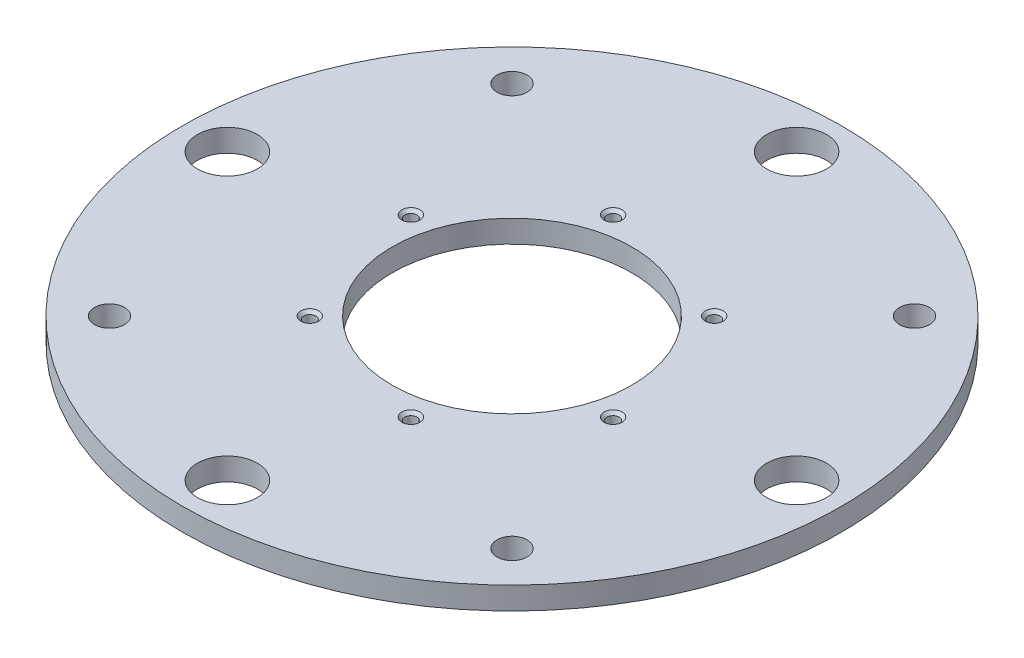
ISO-10303-21;
HEADER;
FILE_DESCRIPTION(('STEP AP214'),'2;1');
FILE_NAME('part.step','',(''),(''),'','','');
FILE_SCHEMA(('AUTOMOTIVE_DESIGN { 1 0 10303 214 1 1 1 1 }'));
ENDSEC;
DATA;
#1=APPLICATION_CONTEXT('core data for automotive mechanical design processes');
#2=APPLICATION_PROTOCOL_DEFINITION('international standard','automotive_design',2000,#1);
#3=PRODUCT_CONTEXT('',#1,'mechanical');
#4=PRODUCT('Part','Part','',(#3));
#5=PRODUCT_RELATED_PRODUCT_CATEGORY('part','',(#4));
#6=PRODUCT_DEFINITION_FORMATION('','',#4);
#7=PRODUCT_DEFINITION_CONTEXT('part definition',#1,'design');
#8=PRODUCT_DEFINITION('design','',#6,#7);
#9=PRODUCT_DEFINITION_SHAPE('','',#8);
#10=(LENGTH_UNIT() NAMED_UNIT(*) SI_UNIT(.MILLI.,.METRE.));
#11=(NAMED_UNIT(*) PLANE_ANGLE_UNIT() SI_UNIT($,.RADIAN.));
#12=(NAMED_UNIT(*) SI_UNIT($,.STERADIAN.) SOLID_ANGLE_UNIT());
#13=UNCERTAINTY_MEASURE_WITH_UNIT(LENGTH_MEASURE(1.E-05),#10,'distance_accuracy_value','');
#14=(GEOMETRIC_REPRESENTATION_CONTEXT(3) GLOBAL_UNCERTAINTY_ASSIGNED_CONTEXT((#13)) GLOBAL_UNIT_ASSIGNED_CONTEXT((#10,
#11,#12)) REPRESENTATION_CONTEXT('',''));
#15=CARTESIAN_POINT('',(0.,0.,0.));
#16=DIRECTION('',(0.,0.,1.));
#17=DIRECTION('',(1.,0.,0.));
#18=AXIS2_PLACEMENT_3D('',#15,#16,#17);
#19=CARTESIAN_POINT('',(0.,9.525,0.));
#20=DIRECTION('',(0.,1.,0.));
#21=DIRECTION('',(0.,0.,1.));
#22=AXIS2_PLACEMENT_3D('',#19,#20,#21);
#23=PLANE('',#22);
#24=CARTESIAN_POINT('',(-58.5454887757494,9.525,-15.6872164379448));
#25=DIRECTION('',(0.,1.,0.));
#26=DIRECTION('',(0.,0.,1.));
#27=AXIS2_PLACEMENT_3D('',#24,#25,#26);
#28=CIRCLE('',#27,3.81);
#29=CARTESIAN_POINT('',(-58.5454887757494,9.525,-11.8772164379448));
#30=VERTEX_POINT('',#29);
#31=EDGE_CURVE('E176',#30,#30,#28,.T.);
#32=ORIENTED_EDGE('',*,*,#31,.F.);
#33=EDGE_LOOP('',(#32));
#34=FACE_BOUND('',#33,.T.);
#35=CARTESIAN_POINT('',(-15.6872164379468,9.525,-58.5454887757503));
#36=DIRECTION('',(0.,1.,0.));
#37=DIRECTION('',(0.,0.,1.));
#38=AXIS2_PLACEMENT_3D('',#35,#36,#37);
#39=CIRCLE('',#38,3.81);
#40=CARTESIAN_POINT('',(-15.6872164379468,9.525,-54.7354887757503));
#41=VERTEX_POINT('',#40);
#42=EDGE_CURVE('E164',#41,#41,#39,.T.);
#43=ORIENTED_EDGE('',*,*,#42,.F.);
#44=EDGE_LOOP('',(#43));
#45=FACE_BOUND('',#44,.T.);
#46=CARTESIAN_POINT('',(42.8582723378026,9.525,-42.8582723378025));
#47=DIRECTION('',(0.,1.,0.));
#48=DIRECTION('',(0.,0.,1.));
#49=AXIS2_PLACEMENT_3D('',#46,#47,#48);
#50=CIRCLE('',#49,3.81);
#51=CARTESIAN_POINT('',(42.8582723378026,9.525,-39.0482723378025));
#52=VERTEX_POINT('',#51);
#53=EDGE_CURVE('E152',#52,#52,#50,.T.);
#54=ORIENTED_EDGE('',*,*,#53,.F.);
#55=EDGE_LOOP('',(#54));
#56=FACE_BOUND('',#55,.T.);
#57=CARTESIAN_POINT('',(58.5454887757501,9.525,15.6872164379478));
#58=DIRECTION('',(0.,1.,0.));
#59=DIRECTION('',(0.,0.,1.));
#60=AXIS2_PLACEMENT_3D('',#57,#58,#59);
#61=CIRCLE('',#60,3.81);
#62=CARTESIAN_POINT('',(58.5454887757501,9.525,19.4972164379478));
#63=VERTEX_POINT('',#62);
#64=EDGE_CURVE('E140',#63,#63,#61,.T.);
#65=ORIENTED_EDGE('',*,*,#64,.F.);
#66=EDGE_LOOP('',(#65));
#67=FACE_BOUND('',#66,.T.);
#68=CARTESIAN_POINT('',(15.6872164379472,9.525,58.5454887757502));
#69=DIRECTION('',(0.,1.,0.));
#70=DIRECTION('',(0.,0.,1.));
#71=AXIS2_PLACEMENT_3D('',#68,#69,#70);
#72=CIRCLE('',#71,3.81);
#73=CARTESIAN_POINT('',(15.6872164379472,9.525,62.3554887757502));
#74=VERTEX_POINT('',#73);
#75=EDGE_CURVE('E128',#74,#74,#72,.T.);
#76=ORIENTED_EDGE('',*,*,#75,.F.);
#77=EDGE_LOOP('',(#76));
#78=FACE_BOUND('',#77,.T.);
#79=CARTESIAN_POINT('',(-42.8582723378026,9.525,42.8582723378025));
#80=DIRECTION('',(0.,1.,0.));
#81=DIRECTION('',(0.,0.,1.));
#82=AXIS2_PLACEMENT_3D('',#79,#80,#81);
#83=CIRCLE('',#82,3.81);
#84=CARTESIAN_POINT('',(-42.8582723378026,9.525,46.6682723378025));
#85=VERTEX_POINT('',#84);
#86=EDGE_CURVE('E116',#85,#85,#83,.T.);
#87=ORIENTED_EDGE('',*,*,#86,.F.);
#88=EDGE_LOOP('',(#87));
#89=FACE_BOUND('',#88,.T.);
#90=CARTESIAN_POINT('',(-85.3124331501554,9.525,-85.3124331501519));
#91=DIRECTION('',(0.,1.,0.));
#92=DIRECTION('',(0.,0.,1.));
#93=AXIS2_PLACEMENT_3D('',#90,#91,#92);
#94=CIRCLE('',#93,6.34999999999999);
#95=CARTESIAN_POINT('',(-85.3124331501554,9.525,-78.962433150152));
#96=VERTEX_POINT('',#95);
#97=EDGE_CURVE('E66',#96,#96,#94,.T.);
#98=ORIENTED_EDGE('',*,*,#97,.F.);
#99=EDGE_LOOP('',(#98));
#100=FACE_BOUND('',#99,.T.);
#101=CARTESIAN_POINT('',(0.,9.525,-120.65));
#102=DIRECTION('',(0.,1.,0.));
#103=DIRECTION('',(0.,0.,1.));
#104=AXIS2_PLACEMENT_3D('',#101,#102,#103);
#105=CIRCLE('',#104,12.6746);
#106=CARTESIAN_POINT('',(0.,9.525,-107.9754));
#107=VERTEX_POINT('',#106);
#108=EDGE_CURVE('E103',#107,#107,#105,.T.);
#109=ORIENTED_EDGE('',*,*,#108,.F.);
#110=EDGE_LOOP('',(#109));
#111=FACE_BOUND('',#110,.T.);
#112=CARTESIAN_POINT('',(85.3124331501571,9.525,-85.3124331501568));
#113=DIRECTION('',(0.,1.,0.));
#114=DIRECTION('',(0.,0.,1.));
#115=AXIS2_PLACEMENT_3D('',#112,#113,#114);
#116=CIRCLE('',#115,6.34999999999999);
#117=CARTESIAN_POINT('',(85.3124331501571,9.525,-78.9624331501568));
#118=VERTEX_POINT('',#117);
#119=EDGE_CURVE('E97',#118,#118,#116,.T.);
#120=ORIENTED_EDGE('',*,*,#119,.F.);
#121=EDGE_LOOP('',(#120));
#122=FACE_BOUND('',#121,.T.);
#123=CARTESIAN_POINT('',(120.65,9.525,0.));
#124=DIRECTION('',(0.,1.,0.));
#125=DIRECTION('',(0.,0.,1.));
#126=AXIS2_PLACEMENT_3D('',#123,#124,#125);
#127=CIRCLE('',#126,12.6746);
#128=CARTESIAN_POINT('',(120.65,9.525,12.6746));
#129=VERTEX_POINT('',#128);
#130=EDGE_CURVE('E91',#129,#129,#127,.T.);
#131=ORIENTED_EDGE('',*,*,#130,.F.);
#132=EDGE_LOOP('',(#131));
#133=FACE_BOUND('',#132,.T.);
#134=CARTESIAN_POINT('',(85.312433150162,9.525,85.3124331501558));
#135=DIRECTION('',(0.,1.,0.));
#136=DIRECTION('',(0.,0.,1.));
#137=AXIS2_PLACEMENT_3D('',#134,#135,#136);
#138=CIRCLE('',#137,6.35000000000011);
#139=CARTESIAN_POINT('',(85.312433150162,9.525,91.6624331501559));
#140=VERTEX_POINT('',#139);
#141=EDGE_CURVE('E85',#140,#140,#138,.T.);
#142=ORIENTED_EDGE('',*,*,#141,.F.);
#143=EDGE_LOOP('',(#142));
#144=FACE_BOUND('',#143,.T.);
#145=CARTESIAN_POINT('',(0.,9.525,120.65));
#146=DIRECTION('',(0.,1.,0.));
#147=DIRECTION('',(0.,0.,1.));
#148=AXIS2_PLACEMENT_3D('',#145,#146,#147);
#149=CIRCLE('',#148,12.6746);
#150=CARTESIAN_POINT('',(0.,9.525,133.3246));
#151=VERTEX_POINT('',#150);
#152=EDGE_CURVE('E79',#151,#151,#149,.T.);
#153=ORIENTED_EDGE('',*,*,#152,.F.);
#154=EDGE_LOOP('',(#153));
#155=FACE_BOUND('',#154,.T.);
#156=CARTESIAN_POINT('',(-85.3124331501506,9.525,85.3124331501606));
#157=DIRECTION('',(0.,1.,0.));
#158=DIRECTION('',(0.,0.,1.));
#159=AXIS2_PLACEMENT_3D('',#156,#157,#158);
#160=CIRCLE('',#159,6.34999999999999);
#161=CARTESIAN_POINT('',(-85.3124331501506,9.525,91.6624331501606));
#162=VERTEX_POINT('',#161);
#163=EDGE_CURVE('E72',#162,#162,#160,.T.);
#164=ORIENTED_EDGE('',*,*,#163,.F.);
#165=EDGE_LOOP('',(#164));
#166=FACE_BOUND('',#165,.T.);
#167=CARTESIAN_POINT('',(-120.65,9.525,0.));
#168=DIRECTION('',(0.,1.,0.));
#169=DIRECTION('',(0.,0.,1.));
#170=AXIS2_PLACEMENT_3D('',#167,#168,#169);
#171=CIRCLE('',#170,12.6746);
#172=CARTESIAN_POINT('',(-120.65,9.525,12.6746));
#173=VERTEX_POINT('',#172);
#174=EDGE_CURVE('E63',#173,#173,#171,.T.);
#175=ORIENTED_EDGE('',*,*,#174,.F.);
#176=EDGE_LOOP('',(#175));
#177=FACE_BOUND('',#176,.T.);
#178=CARTESIAN_POINT('',(0.,9.525,0.));
#179=DIRECTION('',(0.,1.,0.));
#180=DIRECTION('',(0.,0.,1.));
#181=AXIS2_PLACEMENT_3D('',#178,#179,#180);
#182=CIRCLE('',#181,139.7);
#183=CARTESIAN_POINT('',(0.,9.525,139.7));
#184=VERTEX_POINT('',#183);
#185=EDGE_CURVE('E12',#184,#184,#182,.T.);
#186=ORIENTED_EDGE('',*,*,#185,.T.);
#187=EDGE_LOOP('',(#186));
#188=FACE_BOUND('',#187,.T.);
#189=CARTESIAN_POINT('',(0.,9.525,0.));
#190=DIRECTION('',(0.,1.,0.));
#191=DIRECTION('',(0.,0.,1.));
#192=AXIS2_PLACEMENT_3D('',#189,#190,#191);
#193=CIRCLE('',#192,50.8);
#194=CARTESIAN_POINT('',(0.,9.525,50.8));
#195=VERTEX_POINT('',#194);
#196=EDGE_CURVE('E55',#195,#195,#193,.T.);
#197=ORIENTED_EDGE('',*,*,#196,.F.);
#198=EDGE_LOOP('',(#197));
#199=FACE_BOUND('',#198,.T.);
#200=ADVANCED_FACE('F44',(#34,#45,#56,#67,#78,#89,#100,#111,#122,#133,#144,#155,#166,#177,#188,
#199),#23,.T.);
#201=CARTESIAN_POINT('',(0.,0.,0.));
#202=DIRECTION('',(0.,1.,0.));
#203=DIRECTION('',(0.,0.,1.));
#204=AXIS2_PLACEMENT_3D('',#201,#202,#203);
#205=PLANE('',#204);
#206=CARTESIAN_POINT('',(-58.5454887757494,0.,-15.6872164379448));
#207=DIRECTION('',(0.,1.,0.));
#208=DIRECTION('',(0.,0.,1.));
#209=AXIS2_PLACEMENT_3D('',#206,#207,#208);
#210=CIRCLE('',#209,3.80999999999999);
#211=CARTESIAN_POINT('',(-58.5454887757494,0.,-11.8772164379448));
#212=VERTEX_POINT('',#211);
#213=EDGE_CURVE('E179',#212,#212,#210,.T.);
#214=ORIENTED_EDGE('',*,*,#213,.T.);
#215=EDGE_LOOP('',(#214));
#216=FACE_BOUND('',#215,.T.);
#217=CARTESIAN_POINT('',(-15.6872164379468,0.,-58.5454887757503));
#218=DIRECTION('',(0.,1.,0.));
#219=DIRECTION('',(0.,0.,1.));
#220=AXIS2_PLACEMENT_3D('',#217,#218,#219);
#221=CIRCLE('',#220,3.81);
#222=CARTESIAN_POINT('',(-15.6872164379468,0.,-54.7354887757503));
#223=VERTEX_POINT('',#222);
#224=EDGE_CURVE('E167',#223,#223,#221,.T.);
#225=ORIENTED_EDGE('',*,*,#224,.T.);
#226=EDGE_LOOP('',(#225));
#227=FACE_BOUND('',#226,.T.);
#228=CARTESIAN_POINT('',(42.8582723378026,0.,-42.8582723378025));
#229=DIRECTION('',(0.,1.,0.));
#230=DIRECTION('',(0.,0.,1.));
#231=AXIS2_PLACEMENT_3D('',#228,#229,#230);
#232=CIRCLE('',#231,3.81);
#233=CARTESIAN_POINT('',(42.8582723378026,0.,-39.0482723378025));
#234=VERTEX_POINT('',#233);
#235=EDGE_CURVE('E155',#234,#234,#232,.T.);
#236=ORIENTED_EDGE('',*,*,#235,.T.);
#237=EDGE_LOOP('',(#236));
#238=FACE_BOUND('',#237,.T.);
#239=CARTESIAN_POINT('',(58.5454887757501,0.,15.6872164379478));
#240=DIRECTION('',(0.,1.,0.));
#241=DIRECTION('',(0.,0.,1.));
#242=AXIS2_PLACEMENT_3D('',#239,#240,#241);
#243=CIRCLE('',#242,3.80999999999999);
#244=CARTESIAN_POINT('',(58.5454887757501,0.,19.4972164379478));
#245=VERTEX_POINT('',#244);
#246=EDGE_CURVE('E143',#245,#245,#243,.T.);
#247=ORIENTED_EDGE('',*,*,#246,.T.);
#248=EDGE_LOOP('',(#247));
#249=FACE_BOUND('',#248,.T.);
#250=CARTESIAN_POINT('',(15.6872164379472,0.,58.5454887757502));
#251=DIRECTION('',(0.,1.,0.));
#252=DIRECTION('',(0.,0.,1.));
#253=AXIS2_PLACEMENT_3D('',#250,#251,#252);
#254=CIRCLE('',#253,3.81);
#255=CARTESIAN_POINT('',(15.6872164379472,0.,62.3554887757502));
#256=VERTEX_POINT('',#255);
#257=EDGE_CURVE('E131',#256,#256,#254,.T.);
#258=ORIENTED_EDGE('',*,*,#257,.T.);
#259=EDGE_LOOP('',(#258));
#260=FACE_BOUND('',#259,.T.);
#261=CARTESIAN_POINT('',(-42.8582723378026,0.,42.8582723378025));
#262=DIRECTION('',(0.,1.,0.));
#263=DIRECTION('',(0.,0.,1.));
#264=AXIS2_PLACEMENT_3D('',#261,#262,#263);
#265=CIRCLE('',#264,3.81);
#266=CARTESIAN_POINT('',(-42.8582723378026,0.,46.6682723378025));
#267=VERTEX_POINT('',#266);
#268=EDGE_CURVE('E119',#267,#267,#265,.T.);
#269=ORIENTED_EDGE('',*,*,#268,.T.);
#270=EDGE_LOOP('',(#269));
#271=FACE_BOUND('',#270,.T.);
#272=CARTESIAN_POINT('',(-85.3124331501554,0.,-85.3124331501519));
#273=DIRECTION('',(0.,1.,0.));
#274=DIRECTION('',(0.,0.,1.));
#275=AXIS2_PLACEMENT_3D('',#272,#273,#274);
#276=CIRCLE('',#275,6.34999999999999);
#277=CARTESIAN_POINT('',(-85.3124331501554,0.,-78.962433150152));
#278=VERTEX_POINT('',#277);
#279=EDGE_CURVE('E106',#278,#278,#276,.T.);
#280=ORIENTED_EDGE('',*,*,#279,.T.);
#281=EDGE_LOOP('',(#280));
#282=FACE_BOUND('',#281,.T.);
#283=CARTESIAN_POINT('',(0.,0.,-120.65));
#284=DIRECTION('',(0.,1.,0.));
#285=DIRECTION('',(0.,0.,1.));
#286=AXIS2_PLACEMENT_3D('',#283,#284,#285);
#287=CIRCLE('',#286,12.6746);
#288=CARTESIAN_POINT('',(0.,0.,-107.9754));
#289=VERTEX_POINT('',#288);
#290=EDGE_CURVE('E100',#289,#289,#287,.T.);
#291=ORIENTED_EDGE('',*,*,#290,.T.);
#292=EDGE_LOOP('',(#291));
#293=FACE_BOUND('',#292,.T.);
#294=CARTESIAN_POINT('',(85.3124331501571,0.,-85.3124331501568));
#295=DIRECTION('',(0.,1.,0.));
#296=DIRECTION('',(0.,0.,1.));
#297=AXIS2_PLACEMENT_3D('',#294,#295,#296);
#298=CIRCLE('',#297,6.34999999999999);
#299=CARTESIAN_POINT('',(85.3124331501571,0.,-78.9624331501568));
#300=VERTEX_POINT('',#299);
#301=EDGE_CURVE('E94',#300,#300,#298,.T.);
#302=ORIENTED_EDGE('',*,*,#301,.T.);
#303=EDGE_LOOP('',(#302));
#304=FACE_BOUND('',#303,.T.);
#305=CARTESIAN_POINT('',(120.65,0.,0.));
#306=DIRECTION('',(0.,1.,0.));
#307=DIRECTION('',(0.,0.,1.));
#308=AXIS2_PLACEMENT_3D('',#305,#306,#307);
#309=CIRCLE('',#308,12.6746);
#310=CARTESIAN_POINT('',(120.65,0.,12.6746));
#311=VERTEX_POINT('',#310);
#312=EDGE_CURVE('E88',#311,#311,#309,.T.);
#313=ORIENTED_EDGE('',*,*,#312,.T.);
#314=EDGE_LOOP('',(#313));
#315=FACE_BOUND('',#314,.T.);
#316=CARTESIAN_POINT('',(85.312433150162,0.,85.3124331501558));
#317=DIRECTION('',(0.,1.,0.));
#318=DIRECTION('',(0.,0.,1.));
#319=AXIS2_PLACEMENT_3D('',#316,#317,#318);
#320=CIRCLE('',#319,6.35000000000011);
#321=CARTESIAN_POINT('',(85.312433150162,0.,91.6624331501559));
#322=VERTEX_POINT('',#321);
#323=EDGE_CURVE('E82',#322,#322,#320,.T.);
#324=ORIENTED_EDGE('',*,*,#323,.T.);
#325=EDGE_LOOP('',(#324));
#326=FACE_BOUND('',#325,.T.);
#327=CARTESIAN_POINT('',(0.,0.,120.65));
#328=DIRECTION('',(0.,1.,0.));
#329=DIRECTION('',(0.,0.,1.));
#330=AXIS2_PLACEMENT_3D('',#327,#328,#329);
#331=CIRCLE('',#330,12.6746);
#332=CARTESIAN_POINT('',(0.,0.,133.3246));
#333=VERTEX_POINT('',#332);
#334=EDGE_CURVE('E76',#333,#333,#331,.T.);
#335=ORIENTED_EDGE('',*,*,#334,.T.);
#336=EDGE_LOOP('',(#335));
#337=FACE_BOUND('',#336,.T.);
#338=CARTESIAN_POINT('',(-85.3124331501506,0.,85.3124331501606));
#339=DIRECTION('',(0.,1.,0.));
#340=DIRECTION('',(0.,0.,1.));
#341=AXIS2_PLACEMENT_3D('',#338,#339,#340);
#342=CIRCLE('',#341,6.34999999999999);
#343=CARTESIAN_POINT('',(-85.3124331501506,0.,91.6624331501606));
#344=VERTEX_POINT('',#343);
#345=EDGE_CURVE('E69',#344,#344,#342,.T.);
#346=ORIENTED_EDGE('',*,*,#345,.T.);
#347=EDGE_LOOP('',(#346));
#348=FACE_BOUND('',#347,.T.);
#349=CARTESIAN_POINT('',(-120.65,0.,0.));
#350=DIRECTION('',(0.,1.,0.));
#351=DIRECTION('',(0.,0.,1.));
#352=AXIS2_PLACEMENT_3D('',#349,#350,#351);
#353=CIRCLE('',#352,12.6746);
#354=CARTESIAN_POINT('',(-120.65,0.,12.6746));
#355=VERTEX_POINT('',#354);
#356=EDGE_CURVE('E60',#355,#355,#353,.T.);
#357=ORIENTED_EDGE('',*,*,#356,.T.);
#358=EDGE_LOOP('',(#357));
#359=FACE_BOUND('',#358,.T.);
#360=CARTESIAN_POINT('',(0.,0.,0.));
#361=DIRECTION('',(0.,1.,0.));
#362=DIRECTION('',(0.,0.,1.));
#363=AXIS2_PLACEMENT_3D('',#360,#361,#362);
#364=CIRCLE('',#363,139.7);
#365=CARTESIAN_POINT('',(0.,0.,139.7));
#366=VERTEX_POINT('',#365);
#367=EDGE_CURVE('E48',#366,#366,#364,.T.);
#368=ORIENTED_EDGE('',*,*,#367,.F.);
#369=EDGE_LOOP('',(#368));
#370=FACE_BOUND('',#369,.T.);
#371=CARTESIAN_POINT('',(0.,0.,0.));
#372=DIRECTION('',(0.,1.,0.));
#373=DIRECTION('',(0.,0.,1.));
#374=AXIS2_PLACEMENT_3D('',#371,#372,#373);
#375=CIRCLE('',#374,50.8);
#376=CARTESIAN_POINT('',(0.,0.,50.8));
#377=VERTEX_POINT('',#376);
#378=EDGE_CURVE('E57',#377,#377,#375,.T.);
#379=ORIENTED_EDGE('',*,*,#378,.T.);
#380=EDGE_LOOP('',(#379));
#381=FACE_BOUND('',#380,.T.);
#382=ADVANCED_FACE('F183',(#216,#227,#238,#249,#260,#271,#282,#293,#304,#315,#326,#337,#348,
#359,#370,#381),#205,.F.);
#383=CARTESIAN_POINT('',(0.,9.525,0.));
#384=DIRECTION('',(0.,-1.,0.));
#385=DIRECTION('',(0.,0.,-1.));
#386=AXIS2_PLACEMENT_3D('',#383,#384,#385);
#387=CYLINDRICAL_SURFACE('',#386,139.7);
#388=ORIENTED_EDGE('',*,*,#185,.F.);
#389=EDGE_LOOP('',(#388));
#390=FACE_BOUND('',#389,.T.);
#391=ORIENTED_EDGE('',*,*,#367,.T.);
#392=EDGE_LOOP('',(#391));
#393=FACE_BOUND('',#392,.T.);
#394=ADVANCED_FACE('F46',(#390,#393),#387,.T.);
#395=CARTESIAN_POINT('',(0.,9.525,0.));
#396=DIRECTION('',(0.,-1.,0.));
#397=DIRECTION('',(0.,0.,-1.));
#398=AXIS2_PLACEMENT_3D('',#395,#396,#397);
#399=CYLINDRICAL_SURFACE('',#398,50.8);
#400=ORIENTED_EDGE('',*,*,#196,.T.);
#401=EDGE_LOOP('',(#400));
#402=FACE_BOUND('',#401,.T.);
#403=ORIENTED_EDGE('',*,*,#378,.F.);
#404=EDGE_LOOP('',(#403));
#405=FACE_BOUND('',#404,.T.);
#406=ADVANCED_FACE('F236',(#402,#405),#399,.F.);
#407=CARTESIAN_POINT('',(-120.65,0.,0.));
#408=DIRECTION('',(0.,1.,0.));
#409=DIRECTION('',(0.,0.,1.));
#410=AXIS2_PLACEMENT_3D('',#407,#408,#409);
#411=CYLINDRICAL_SURFACE('',#410,12.6746);
#412=ORIENTED_EDGE('',*,*,#356,.F.);
#413=EDGE_LOOP('',(#412));
#414=FACE_BOUND('',#413,.T.);
#415=ORIENTED_EDGE('',*,*,#174,.T.);
#416=EDGE_LOOP('',(#415));
#417=FACE_BOUND('',#416,.T.);
#418=ADVANCED_FACE('F239',(#414,#417),#411,.F.);
#419=CARTESIAN_POINT('',(-85.3124331501506,0.,85.3124331501606));
#420=DIRECTION('',(0.,1.,0.));
#421=DIRECTION('',(0.,0.,1.));
#422=AXIS2_PLACEMENT_3D('',#419,#420,#421);
#423=CYLINDRICAL_SURFACE('',#422,6.34999999999999);
#424=ORIENTED_EDGE('',*,*,#345,.F.);
#425=EDGE_LOOP('',(#424));
#426=FACE_BOUND('',#425,.T.);
#427=ORIENTED_EDGE('',*,*,#163,.T.);
#428=EDGE_LOOP('',(#427));
#429=FACE_BOUND('',#428,.T.);
#430=ADVANCED_FACE('F251',(#426,#429),#423,.F.);
#431=CARTESIAN_POINT('',(0.,0.,120.65));
#432=DIRECTION('',(0.,1.,0.));
#433=DIRECTION('',(0.,0.,1.));
#434=AXIS2_PLACEMENT_3D('',#431,#432,#433);
#435=CYLINDRICAL_SURFACE('',#434,12.6746);
#436=ORIENTED_EDGE('',*,*,#334,.F.);
#437=EDGE_LOOP('',(#436));
#438=FACE_BOUND('',#437,.T.);
#439=ORIENTED_EDGE('',*,*,#152,.T.);
#440=EDGE_LOOP('',(#439));
#441=FACE_BOUND('',#440,.T.);
#442=ADVANCED_FACE('F255',(#438,#441),#435,.F.);
#443=CARTESIAN_POINT('',(85.312433150162,0.,85.3124331501558));
#444=DIRECTION('',(0.,1.,0.));
#445=DIRECTION('',(0.,0.,1.));
#446=AXIS2_PLACEMENT_3D('',#443,#444,#445);
#447=CYLINDRICAL_SURFACE('',#446,6.35000000000011);
#448=ORIENTED_EDGE('',*,*,#323,.F.);
#449=EDGE_LOOP('',(#448));
#450=FACE_BOUND('',#449,.T.);
#451=ORIENTED_EDGE('',*,*,#141,.T.);
#452=EDGE_LOOP('',(#451));
#453=FACE_BOUND('',#452,.T.);
#454=ADVANCED_FACE('F259',(#450,#453),#447,.F.);
#455=CARTESIAN_POINT('',(120.65,0.,0.));
#456=DIRECTION('',(0.,1.,0.));
#457=DIRECTION('',(0.,0.,1.));
#458=AXIS2_PLACEMENT_3D('',#455,#456,#457);
#459=CYLINDRICAL_SURFACE('',#458,12.6746);
#460=ORIENTED_EDGE('',*,*,#312,.F.);
#461=EDGE_LOOP('',(#460));
#462=FACE_BOUND('',#461,.T.);
#463=ORIENTED_EDGE('',*,*,#130,.T.);
#464=EDGE_LOOP('',(#463));
#465=FACE_BOUND('',#464,.T.);
#466=ADVANCED_FACE('F263',(#462,#465),#459,.F.);
#467=CARTESIAN_POINT('',(85.3124331501571,0.,-85.3124331501568));
#468=DIRECTION('',(0.,1.,0.));
#469=DIRECTION('',(0.,0.,1.));
#470=AXIS2_PLACEMENT_3D('',#467,#468,#469);
#471=CYLINDRICAL_SURFACE('',#470,6.34999999999999);
#472=ORIENTED_EDGE('',*,*,#301,.F.);
#473=EDGE_LOOP('',(#472));
#474=FACE_BOUND('',#473,.T.);
#475=ORIENTED_EDGE('',*,*,#119,.T.);
#476=EDGE_LOOP('',(#475));
#477=FACE_BOUND('',#476,.T.);
#478=ADVANCED_FACE('F267',(#474,#477),#471,.F.);
#479=CARTESIAN_POINT('',(0.,0.,-120.65));
#480=DIRECTION('',(0.,1.,0.));
#481=DIRECTION('',(0.,0.,1.));
#482=AXIS2_PLACEMENT_3D('',#479,#480,#481);
#483=CYLINDRICAL_SURFACE('',#482,12.6746);
#484=ORIENTED_EDGE('',*,*,#290,.F.);
#485=EDGE_LOOP('',(#484));
#486=FACE_BOUND('',#485,.T.);
#487=ORIENTED_EDGE('',*,*,#108,.T.);
#488=EDGE_LOOP('',(#487));
#489=FACE_BOUND('',#488,.T.);
#490=ADVANCED_FACE('F271',(#486,#489),#483,.F.);
#491=CARTESIAN_POINT('',(-85.3124331501554,0.,-85.3124331501519));
#492=DIRECTION('',(0.,1.,0.));
#493=DIRECTION('',(0.,0.,1.));
#494=AXIS2_PLACEMENT_3D('',#491,#492,#493);
#495=CYLINDRICAL_SURFACE('',#494,6.34999999999999);
#496=ORIENTED_EDGE('',*,*,#279,.F.);
#497=EDGE_LOOP('',(#496));
#498=FACE_BOUND('',#497,.T.);
#499=ORIENTED_EDGE('',*,*,#97,.T.);
#500=EDGE_LOOP('',(#499));
#501=FACE_BOUND('',#500,.T.);
#502=ADVANCED_FACE('F275',(#498,#501),#495,.F.);
#503=CARTESIAN_POINT('',(-42.8582723378026,1.2573,42.8582723378025));
#504=DIRECTION('',(0.,-1.,0.));
#505=DIRECTION('',(0.,0.,-1.));
#506=AXIS2_PLACEMENT_3D('',#503,#504,#505);
#507=CONICAL_SURFACE('',#506,2.5527,0.785398163397448);
#508=ORIENTED_EDGE('',*,*,#268,.F.);
#509=EDGE_LOOP('',(#508));
#510=FACE_BOUND('',#509,.T.);
#511=CARTESIAN_POINT('',(-42.8582723378026,1.2573,42.8582723378025));
#512=DIRECTION('',(0.,1.,0.));
#513=DIRECTION('',(0.,0.,1.));
#514=AXIS2_PLACEMENT_3D('',#511,#512,#513);
#515=CIRCLE('',#514,2.5527);
#516=CARTESIAN_POINT('',(-42.8582723378026,1.2573,45.4109723378025));
#517=VERTEX_POINT('',#516);
#518=EDGE_CURVE('E73',#517,#517,#515,.T.);
#519=ORIENTED_EDGE('',*,*,#518,.T.);
#520=EDGE_LOOP('',(#519));
#521=FACE_BOUND('',#520,.T.);
#522=ADVANCED_FACE('F279',(#510,#521),#507,.F.);
#523=CARTESIAN_POINT('',(-42.8582723378026,9.525,42.8582723378025));
#524=DIRECTION('',(0.,1.,0.));
#525=DIRECTION('',(0.,0.,1.));
#526=AXIS2_PLACEMENT_3D('',#523,#524,#525);
#527=CYLINDRICAL_SURFACE('',#526,2.5527);
#528=ORIENTED_EDGE('',*,*,#518,.F.);
#529=EDGE_LOOP('',(#528));
#530=FACE_BOUND('',#529,.T.);
#531=CARTESIAN_POINT('',(-42.8582723378026,8.2677,42.8582723378025));
#532=DIRECTION('',(0.,1.,0.));
#533=DIRECTION('',(0.,0.,1.));
#534=AXIS2_PLACEMENT_3D('',#531,#532,#533);
#535=CIRCLE('',#534,2.5527);
#536=CARTESIAN_POINT('',(-42.8582723378026,8.2677,45.4109723378025));
#537=VERTEX_POINT('',#536);
#538=EDGE_CURVE('E113',#537,#537,#535,.T.);
#539=ORIENTED_EDGE('',*,*,#538,.T.);
#540=EDGE_LOOP('',(#539));
#541=FACE_BOUND('',#540,.T.);
#542=ADVANCED_FACE('F283',(#530,#541),#527,.F.);
#543=CARTESIAN_POINT('',(-42.8582723378026,9.525,42.8582723378025));
#544=DIRECTION('',(0.,1.,0.));
#545=DIRECTION('',(0.,0.,1.));
#546=AXIS2_PLACEMENT_3D('',#543,#544,#545);
#547=CONICAL_SURFACE('',#546,3.81,0.78539816339745);
#548=ORIENTED_EDGE('',*,*,#538,.F.);
#549=EDGE_LOOP('',(#548));
#550=FACE_BOUND('',#549,.T.);
#551=ORIENTED_EDGE('',*,*,#86,.T.);
#552=EDGE_LOOP('',(#551));
#553=FACE_BOUND('',#552,.T.);
#554=ADVANCED_FACE('F287',(#550,#553),#547,.F.);
#555=CARTESIAN_POINT('',(15.6872164379472,1.2573,58.5454887757502));
#556=DIRECTION('',(0.,-1.,0.));
#557=DIRECTION('',(0.,0.,-1.));
#558=AXIS2_PLACEMENT_3D('',#555,#556,#557);
#559=CONICAL_SURFACE('',#558,2.5527,0.785398163397447);
#560=ORIENTED_EDGE('',*,*,#257,.F.);
#561=EDGE_LOOP('',(#560));
#562=FACE_BOUND('',#561,.T.);
#563=CARTESIAN_POINT('',(15.6872164379472,1.2573,58.5454887757502));
#564=DIRECTION('',(0.,1.,0.));
#565=DIRECTION('',(0.,0.,1.));
#566=AXIS2_PLACEMENT_3D('',#563,#564,#565);
#567=CIRCLE('',#566,2.5527);
#568=CARTESIAN_POINT('',(15.6872164379472,1.2573,61.0981887757502));
#569=VERTEX_POINT('',#568);
#570=EDGE_CURVE('E122',#569,#569,#567,.T.);
#571=ORIENTED_EDGE('',*,*,#570,.T.);
#572=EDGE_LOOP('',(#571));
#573=FACE_BOUND('',#572,.T.);
#574=ADVANCED_FACE('F291',(#562,#573),#559,.F.);
#575=CARTESIAN_POINT('',(15.6872164379472,9.525,58.5454887757502));
#576=DIRECTION('',(0.,1.,0.));
#577=DIRECTION('',(0.,0.,1.));
#578=AXIS2_PLACEMENT_3D('',#575,#576,#577);
#579=CYLINDRICAL_SURFACE('',#578,2.5527);
#580=ORIENTED_EDGE('',*,*,#570,.F.);
#581=EDGE_LOOP('',(#580));
#582=FACE_BOUND('',#581,.T.);
#583=CARTESIAN_POINT('',(15.6872164379472,8.2677,58.5454887757502));
#584=DIRECTION('',(0.,1.,0.));
#585=DIRECTION('',(0.,0.,1.));
#586=AXIS2_PLACEMENT_3D('',#583,#584,#585);
#587=CIRCLE('',#586,2.5527);
#588=CARTESIAN_POINT('',(15.6872164379472,8.2677,61.0981887757502));
#589=VERTEX_POINT('',#588);
#590=EDGE_CURVE('E125',#589,#589,#587,.T.);
#591=ORIENTED_EDGE('',*,*,#590,.T.);
#592=EDGE_LOOP('',(#591));
#593=FACE_BOUND('',#592,.T.);
#594=ADVANCED_FACE('F295',(#582,#593),#579,.F.);
#595=CARTESIAN_POINT('',(15.6872164379472,9.525,58.5454887757502));
#596=DIRECTION('',(0.,1.,0.));
#597=DIRECTION('',(0.,0.,1.));
#598=AXIS2_PLACEMENT_3D('',#595,#596,#597);
#599=CONICAL_SURFACE('',#598,3.81,0.785398163397448);
#600=ORIENTED_EDGE('',*,*,#590,.F.);
#601=EDGE_LOOP('',(#600));
#602=FACE_BOUND('',#601,.T.);
#603=ORIENTED_EDGE('',*,*,#75,.T.);
#604=EDGE_LOOP('',(#603));
#605=FACE_BOUND('',#604,.T.);
#606=ADVANCED_FACE('F299',(#602,#605),#599,.F.);
#607=CARTESIAN_POINT('',(58.5454887757501,1.2573,15.6872164379478));
#608=DIRECTION('',(0.,-1.,0.));
#609=DIRECTION('',(0.,0.,-1.));
#610=AXIS2_PLACEMENT_3D('',#607,#608,#609);
#611=CONICAL_SURFACE('',#610,2.5527,0.785398163397446);
#612=ORIENTED_EDGE('',*,*,#246,.F.);
#613=EDGE_LOOP('',(#612));
#614=FACE_BOUND('',#613,.T.);
#615=CARTESIAN_POINT('',(58.5454887757501,1.2573,15.6872164379478));
#616=DIRECTION('',(0.,1.,0.));
#617=DIRECTION('',(0.,0.,1.));
#618=AXIS2_PLACEMENT_3D('',#615,#616,#617);
#619=CIRCLE('',#618,2.5527);
#620=CARTESIAN_POINT('',(58.5454887757501,1.2573,18.2399164379478));
#621=VERTEX_POINT('',#620);
#622=EDGE_CURVE('E134',#621,#621,#619,.T.);
#623=ORIENTED_EDGE('',*,*,#622,.T.);
#624=EDGE_LOOP('',(#623));
#625=FACE_BOUND('',#624,.T.);
#626=ADVANCED_FACE('F303',(#614,#625),#611,.F.);
#627=CARTESIAN_POINT('',(58.5454887757501,9.525,15.6872164379478));
#628=DIRECTION('',(0.,1.,0.));
#629=DIRECTION('',(0.,0.,1.));
#630=AXIS2_PLACEMENT_3D('',#627,#628,#629);
#631=CYLINDRICAL_SURFACE('',#630,2.5527);
#632=ORIENTED_EDGE('',*,*,#622,.F.);
#633=EDGE_LOOP('',(#632));
#634=FACE_BOUND('',#633,.T.);
#635=CARTESIAN_POINT('',(58.5454887757501,8.2677,15.6872164379478));
#636=DIRECTION('',(0.,1.,0.));
#637=DIRECTION('',(0.,0.,1.));
#638=AXIS2_PLACEMENT_3D('',#635,#636,#637);
#639=CIRCLE('',#638,2.5527);
#640=CARTESIAN_POINT('',(58.5454887757501,8.2677,18.2399164379478));
#641=VERTEX_POINT('',#640);
#642=EDGE_CURVE('E137',#641,#641,#639,.T.);
#643=ORIENTED_EDGE('',*,*,#642,.T.);
#644=EDGE_LOOP('',(#643));
#645=FACE_BOUND('',#644,.T.);
#646=ADVANCED_FACE('F307',(#634,#645),#631,.F.);
#647=CARTESIAN_POINT('',(58.5454887757501,9.525,15.6872164379478));
#648=DIRECTION('',(0.,1.,0.));
#649=DIRECTION('',(0.,0.,1.));
#650=AXIS2_PLACEMENT_3D('',#647,#648,#649);
#651=CONICAL_SURFACE('',#650,3.81,0.78539816339745);
#652=ORIENTED_EDGE('',*,*,#642,.F.);
#653=EDGE_LOOP('',(#652));
#654=FACE_BOUND('',#653,.T.);
#655=ORIENTED_EDGE('',*,*,#64,.T.);
#656=EDGE_LOOP('',(#655));
#657=FACE_BOUND('',#656,.T.);
#658=ADVANCED_FACE('F311',(#654,#657),#651,.F.);
#659=CARTESIAN_POINT('',(42.8582723378026,1.2573,-42.8582723378025));
#660=DIRECTION('',(0.,-1.,0.));
#661=DIRECTION('',(0.,0.,-1.));
#662=AXIS2_PLACEMENT_3D('',#659,#660,#661);
#663=CONICAL_SURFACE('',#662,2.5527,0.785398163397448);
#664=ORIENTED_EDGE('',*,*,#235,.F.);
#665=EDGE_LOOP('',(#664));
#666=FACE_BOUND('',#665,.T.);
#667=CARTESIAN_POINT('',(42.8582723378026,1.2573,-42.8582723378025));
#668=DIRECTION('',(0.,1.,0.));
#669=DIRECTION('',(0.,0.,1.));
#670=AXIS2_PLACEMENT_3D('',#667,#668,#669);
#671=CIRCLE('',#670,2.5527);
#672=CARTESIAN_POINT('',(42.8582723378026,1.2573,-40.3055723378025));
#673=VERTEX_POINT('',#672);
#674=EDGE_CURVE('E146',#673,#673,#671,.T.);
#675=ORIENTED_EDGE('',*,*,#674,.T.);
#676=EDGE_LOOP('',(#675));
#677=FACE_BOUND('',#676,.T.);
#678=ADVANCED_FACE('F315',(#666,#677),#663,.F.);
#679=CARTESIAN_POINT('',(42.8582723378026,9.525,-42.8582723378025));
#680=DIRECTION('',(0.,1.,0.));
#681=DIRECTION('',(0.,0.,1.));
#682=AXIS2_PLACEMENT_3D('',#679,#680,#681);
#683=CYLINDRICAL_SURFACE('',#682,2.5527);
#684=ORIENTED_EDGE('',*,*,#674,.F.);
#685=EDGE_LOOP('',(#684));
#686=FACE_BOUND('',#685,.T.);
#687=CARTESIAN_POINT('',(42.8582723378026,8.2677,-42.8582723378025));
#688=DIRECTION('',(0.,1.,0.));
#689=DIRECTION('',(0.,0.,1.));
#690=AXIS2_PLACEMENT_3D('',#687,#688,#689);
#691=CIRCLE('',#690,2.5527);
#692=CARTESIAN_POINT('',(42.8582723378026,8.2677,-40.3055723378025));
#693=VERTEX_POINT('',#692);
#694=EDGE_CURVE('E149',#693,#693,#691,.T.);
#695=ORIENTED_EDGE('',*,*,#694,.T.);
#696=EDGE_LOOP('',(#695));
#697=FACE_BOUND('',#696,.T.);
#698=ADVANCED_FACE('F319',(#686,#697),#683,.F.);
#699=CARTESIAN_POINT('',(42.8582723378026,9.525,-42.8582723378025));
#700=DIRECTION('',(0.,1.,0.));
#701=DIRECTION('',(0.,0.,1.));
#702=AXIS2_PLACEMENT_3D('',#699,#700,#701);
#703=CONICAL_SURFACE('',#702,3.81,0.78539816339745);
#704=ORIENTED_EDGE('',*,*,#694,.F.);
#705=EDGE_LOOP('',(#704));
#706=FACE_BOUND('',#705,.T.);
#707=ORIENTED_EDGE('',*,*,#53,.T.);
#708=EDGE_LOOP('',(#707));
#709=FACE_BOUND('',#708,.T.);
#710=ADVANCED_FACE('F323',(#706,#709),#703,.F.);
#711=CARTESIAN_POINT('',(-15.6872164379468,1.2573,-58.5454887757503));
#712=DIRECTION('',(0.,-1.,0.));
#713=DIRECTION('',(0.,0.,-1.));
#714=AXIS2_PLACEMENT_3D('',#711,#712,#713);
#715=CONICAL_SURFACE('',#714,2.5527,0.785398163397447);
#716=ORIENTED_EDGE('',*,*,#224,.F.);
#717=EDGE_LOOP('',(#716));
#718=FACE_BOUND('',#717,.T.);
#719=CARTESIAN_POINT('',(-15.6872164379468,1.2573,-58.5454887757503));
#720=DIRECTION('',(0.,1.,0.));
#721=DIRECTION('',(0.,0.,1.));
#722=AXIS2_PLACEMENT_3D('',#719,#720,#721);
#723=CIRCLE('',#722,2.5527);
#724=CARTESIAN_POINT('',(-15.6872164379468,1.2573,-55.9927887757503));
#725=VERTEX_POINT('',#724);
#726=EDGE_CURVE('E158',#725,#725,#723,.T.);
#727=ORIENTED_EDGE('',*,*,#726,.T.);
#728=EDGE_LOOP('',(#727));
#729=FACE_BOUND('',#728,.T.);
#730=ADVANCED_FACE('F327',(#718,#729),#715,.F.);
#731=CARTESIAN_POINT('',(-15.6872164379468,9.525,-58.5454887757503));
#732=DIRECTION('',(0.,1.,0.));
#733=DIRECTION('',(0.,0.,1.));
#734=AXIS2_PLACEMENT_3D('',#731,#732,#733);
#735=CYLINDRICAL_SURFACE('',#734,2.5527);
#736=ORIENTED_EDGE('',*,*,#726,.F.);
#737=EDGE_LOOP('',(#736));
#738=FACE_BOUND('',#737,.T.);
#739=CARTESIAN_POINT('',(-15.6872164379468,8.2677,-58.5454887757503));
#740=DIRECTION('',(0.,1.,0.));
#741=DIRECTION('',(0.,0.,1.));
#742=AXIS2_PLACEMENT_3D('',#739,#740,#741);
#743=CIRCLE('',#742,2.5527);
#744=CARTESIAN_POINT('',(-15.6872164379468,8.2677,-55.9927887757503));
#745=VERTEX_POINT('',#744);
#746=EDGE_CURVE('E161',#745,#745,#743,.T.);
#747=ORIENTED_EDGE('',*,*,#746,.T.);
#748=EDGE_LOOP('',(#747));
#749=FACE_BOUND('',#748,.T.);
#750=ADVANCED_FACE('F331',(#738,#749),#735,.F.);
#751=CARTESIAN_POINT('',(-15.6872164379468,9.525,-58.5454887757503));
#752=DIRECTION('',(0.,1.,0.));
#753=DIRECTION('',(0.,0.,1.));
#754=AXIS2_PLACEMENT_3D('',#751,#752,#753);
#755=CONICAL_SURFACE('',#754,3.81,0.785398163397448);
#756=ORIENTED_EDGE('',*,*,#746,.F.);
#757=EDGE_LOOP('',(#756));
#758=FACE_BOUND('',#757,.T.);
#759=ORIENTED_EDGE('',*,*,#42,.T.);
#760=EDGE_LOOP('',(#759));
#761=FACE_BOUND('',#760,.T.);
#762=ADVANCED_FACE('F190',(#758,#761),#755,.F.);
#763=CARTESIAN_POINT('',(-58.5454887757494,1.2573,-15.6872164379448));
#764=DIRECTION('',(0.,-1.,0.));
#765=DIRECTION('',(0.,0.,-1.));
#766=AXIS2_PLACEMENT_3D('',#763,#764,#765);
#767=CONICAL_SURFACE('',#766,2.5527,0.785398163397446);
#768=ORIENTED_EDGE('',*,*,#213,.F.);
#769=EDGE_LOOP('',(#768));
#770=FACE_BOUND('',#769,.T.);
#771=CARTESIAN_POINT('',(-58.5454887757494,1.2573,-15.6872164379448));
#772=DIRECTION('',(0.,1.,0.));
#773=DIRECTION('',(0.,0.,1.));
#774=AXIS2_PLACEMENT_3D('',#771,#772,#773);
#775=CIRCLE('',#774,2.5527);
#776=CARTESIAN_POINT('',(-58.5454887757494,1.2573,-13.1345164379448));
#777=VERTEX_POINT('',#776);
#778=EDGE_CURVE('E170',#777,#777,#775,.T.);
#779=ORIENTED_EDGE('',*,*,#778,.T.);
#780=EDGE_LOOP('',(#779));
#781=FACE_BOUND('',#780,.T.);
#782=ADVANCED_FACE('F186',(#770,#781),#767,.F.);
#783=CARTESIAN_POINT('',(-58.5454887757494,9.525,-15.6872164379448));
#784=DIRECTION('',(0.,1.,0.));
#785=DIRECTION('',(0.,0.,1.));
#786=AXIS2_PLACEMENT_3D('',#783,#784,#785);
#787=CYLINDRICAL_SURFACE('',#786,2.5527);
#788=ORIENTED_EDGE('',*,*,#778,.F.);
#789=EDGE_LOOP('',(#788));
#790=FACE_BOUND('',#789,.T.);
#791=CARTESIAN_POINT('',(-58.5454887757494,8.2677,-15.6872164379448));
#792=DIRECTION('',(0.,1.,0.));
#793=DIRECTION('',(0.,0.,1.));
#794=AXIS2_PLACEMENT_3D('',#791,#792,#793);
#795=CIRCLE('',#794,2.5527);
#796=CARTESIAN_POINT('',(-58.5454887757494,8.2677,-13.1345164379448));
#797=VERTEX_POINT('',#796);
#798=EDGE_CURVE('E173',#797,#797,#795,.T.);
#799=ORIENTED_EDGE('',*,*,#798,.T.);
#800=EDGE_LOOP('',(#799));
#801=FACE_BOUND('',#800,.T.);
#802=ADVANCED_FACE('F189',(#790,#801),#787,.F.);
#803=CARTESIAN_POINT('',(-58.5454887757494,9.525,-15.6872164379448));
#804=DIRECTION('',(0.,1.,0.));
#805=DIRECTION('',(0.,0.,1.));
#806=AXIS2_PLACEMENT_3D('',#803,#804,#805);
#807=CONICAL_SURFACE('',#806,3.81,0.78539816339745);
#808=ORIENTED_EDGE('',*,*,#798,.F.);
#809=EDGE_LOOP('',(#808));
#810=FACE_BOUND('',#809,.T.);
#811=ORIENTED_EDGE('',*,*,#31,.T.);
#812=EDGE_LOOP('',(#811));
#813=FACE_BOUND('',#812,.T.);
#814=ADVANCED_FACE('F196',(#810,#813),#807,.F.);
#815=CLOSED_SHELL('',(#200,#382,#394,#406,#418,#430,#442,#454,#466,#478,#490,#502,#522,#542,
#554,#574,#594,#606,#626,#646,#658,#678,#698,#710,#730,#750,#762,#782,#802,#814));
#816=MANIFOLD_SOLID_BREP('B2',#815);
#817=ADVANCED_BREP_SHAPE_REPRESENTATION('',(#18,#816),#14);
#818=SHAPE_DEFINITION_REPRESENTATION(#9,#817);
ENDSEC;
END-ISO-10303-21;
